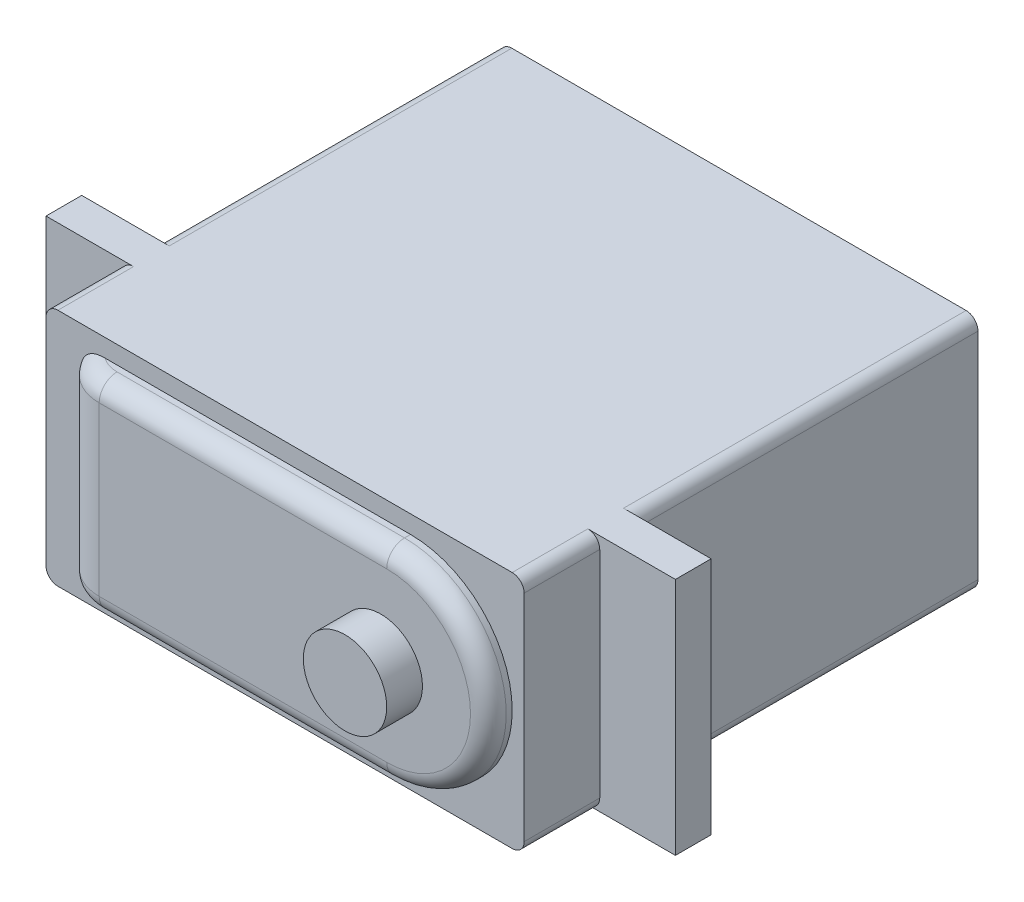
ISO-10303-21;
HEADER;
FILE_DESCRIPTION(('STEP AP214'),'2;1');
FILE_NAME('part.step','',(''),(''),'','','');
FILE_SCHEMA(('AUTOMOTIVE_DESIGN { 1 0 10303 214 1 1 1 1 }'));
ENDSEC;
DATA;
#1=APPLICATION_CONTEXT('core data for automotive mechanical design processes');
#2=APPLICATION_PROTOCOL_DEFINITION('international standard','automotive_design',2000,#1);
#3=PRODUCT_CONTEXT('',#1,'mechanical');
#4=PRODUCT('Part','Part','',(#3));
#5=PRODUCT_RELATED_PRODUCT_CATEGORY('part','',(#4));
#6=PRODUCT_DEFINITION_FORMATION('','',#4);
#7=PRODUCT_DEFINITION_CONTEXT('part definition',#1,'design');
#8=PRODUCT_DEFINITION('design','',#6,#7);
#9=PRODUCT_DEFINITION_SHAPE('','',#8);
#10=(LENGTH_UNIT() NAMED_UNIT(*) SI_UNIT(.MILLI.,.METRE.));
#11=(NAMED_UNIT(*) PLANE_ANGLE_UNIT() SI_UNIT($,.RADIAN.));
#12=(NAMED_UNIT(*) SI_UNIT($,.STERADIAN.) SOLID_ANGLE_UNIT());
#13=UNCERTAINTY_MEASURE_WITH_UNIT(LENGTH_MEASURE(1.E-05),#10,'distance_accuracy_value','');
#14=(GEOMETRIC_REPRESENTATION_CONTEXT(3) GLOBAL_UNCERTAINTY_ASSIGNED_CONTEXT((#13)) GLOBAL_UNIT_ASSIGNED_CONTEXT((#10,
#11,#12)) REPRESENTATION_CONTEXT('',''));
#15=CARTESIAN_POINT('',(0.,0.,0.));
#16=DIRECTION('',(0.,0.,1.));
#17=DIRECTION('',(1.,0.,0.));
#18=AXIS2_PLACEMENT_3D('',#15,#16,#17);
#19=CARTESIAN_POINT('',(0.,0.,38.1));
#20=DIRECTION('',(0.,0.,1.));
#21=DIRECTION('',(1.,0.,0.));
#22=AXIS2_PLACEMENT_3D('',#19,#20,#21);
#23=PLANE('',#22);
#24=DIRECTION('',(0.,1.,0.));
#25=VECTOR('',#24,1.);
#26=CARTESIAN_POINT('',(20.066,10.033,38.1));
#27=LINE('',#26,#25);
#28=CARTESIAN_POINT('',(20.066,-9.03299999999999,38.1));
#29=VERTEX_POINT('',#28);
#30=CARTESIAN_POINT('',(20.066,9.033,38.1));
#31=VERTEX_POINT('',#30);
#32=EDGE_CURVE('E297',#29,#31,#27,.T.);
#33=ORIENTED_EDGE('',*,*,#32,.T.);
#34=CARTESIAN_POINT('',(19.066,9.033,38.1));
#35=DIRECTION('',(0.,0.,1.));
#36=DIRECTION('',(1.,0.,0.));
#37=AXIS2_PLACEMENT_3D('',#34,#35,#36);
#38=CIRCLE('',#37,1.);
#39=CARTESIAN_POINT('',(19.066,10.033,38.1));
#40=VERTEX_POINT('',#39);
#41=EDGE_CURVE('E460',#31,#40,#38,.T.);
#42=ORIENTED_EDGE('',*,*,#41,.T.);
#43=DIRECTION('',(-1.,0.,0.));
#44=VECTOR('',#43,1.);
#45=CARTESIAN_POINT('',(-20.066,10.033,38.1));
#46=LINE('',#45,#44);
#47=CARTESIAN_POINT('',(-19.066,10.033,38.1));
#48=VERTEX_POINT('',#47);
#49=EDGE_CURVE('E300',#40,#48,#46,.T.);
#50=ORIENTED_EDGE('',*,*,#49,.T.);
#51=CARTESIAN_POINT('',(-19.066,9.033,38.1));
#52=DIRECTION('',(0.,0.,1.));
#53=DIRECTION('',(1.,0.,0.));
#54=AXIS2_PLACEMENT_3D('',#51,#52,#53);
#55=CIRCLE('',#54,1.);
#56=CARTESIAN_POINT('',(-20.066,9.033,38.1));
#57=VERTEX_POINT('',#56);
#58=EDGE_CURVE('E458',#48,#57,#55,.T.);
#59=ORIENTED_EDGE('',*,*,#58,.T.);
#60=DIRECTION('',(0.,-1.,0.));
#61=VECTOR('',#60,1.);
#62=CARTESIAN_POINT('',(-20.066,10.033,38.1));
#63=LINE('',#62,#61);
#64=CARTESIAN_POINT('',(-20.066,-9.033,38.1));
#65=VERTEX_POINT('',#64);
#66=EDGE_CURVE('E304',#57,#65,#63,.T.);
#67=ORIENTED_EDGE('',*,*,#66,.T.);
#68=CARTESIAN_POINT('',(-19.066,-9.033,38.1));
#69=DIRECTION('',(0.,0.,1.));
#70=DIRECTION('',(1.,0.,0.));
#71=AXIS2_PLACEMENT_3D('',#68,#69,#70);
#72=CIRCLE('',#71,1.);
#73=CARTESIAN_POINT('',(-19.066,-10.033,38.1));
#74=VERTEX_POINT('',#73);
#75=EDGE_CURVE('E454',#65,#74,#72,.T.);
#76=ORIENTED_EDGE('',*,*,#75,.T.);
#77=DIRECTION('',(1.,0.,0.));
#78=VECTOR('',#77,1.);
#79=CARTESIAN_POINT('',(-20.066,-10.033,38.1));
#80=LINE('',#79,#78);
#81=CARTESIAN_POINT('',(19.066,-10.033,38.1));
#82=VERTEX_POINT('',#81);
#83=EDGE_CURVE('E307',#74,#82,#80,.T.);
#84=ORIENTED_EDGE('',*,*,#83,.T.);
#85=CARTESIAN_POINT('',(19.066,-9.03299999999999,38.1));
#86=DIRECTION('',(0.,0.,1.));
#87=DIRECTION('',(1.,0.,0.));
#88=AXIS2_PLACEMENT_3D('',#85,#86,#87);
#89=CIRCLE('',#88,1.);
#90=EDGE_CURVE('E456',#82,#29,#89,.T.);
#91=ORIENTED_EDGE('',*,*,#90,.T.);
#92=EDGE_LOOP('',(#33,#42,#50,#59,#67,#76,#84,#91));
#93=FACE_BOUND('',#92,.T.);
#94=DIRECTION('',(1.,0.,0.));
#95=VECTOR('',#94,1.);
#96=CARTESIAN_POINT('',(-17.066,-8.533,38.1));
#97=LINE('',#96,#95);
#98=CARTESIAN_POINT('',(-15.1018983848623,-8.533,38.1));
#99=VERTEX_POINT('',#98);
#100=CARTESIAN_POINT('',(10.533,-8.533,38.1));
#101=VERTEX_POINT('',#100);
#102=EDGE_CURVE('E233',#99,#101,#97,.T.);
#103=ORIENTED_EDGE('',*,*,#102,.F.);
#104=CARTESIAN_POINT('',(-15.1018983848623,-8.533,38.1));
#105=CARTESIAN_POINT('',(-15.1861928300058,-8.53303049348242,38.1));
#106=CARTESIAN_POINT('',(-15.2706152750848,-8.53044021391061,38.1));
#107=CARTESIAN_POINT('',(-15.4394485442143,-8.51852978729891,38.1));
#108=CARTESIAN_POINT('',(-15.5238565519978,-8.50917131507559,38.1));
#109=CARTESIAN_POINT('',(-15.6923665934414,-8.48204894050768,38.1));
#110=CARTESIAN_POINT('',(-15.7764542345098,-8.46419067214507,38.1));
#111=CARTESIAN_POINT('',(-15.9418119669954,-8.41885763557327,38.1));
#112=CARTESIAN_POINT('',(-16.0230887290638,-8.39140763843768,38.1));
#113=CARTESIAN_POINT('',(-16.1870195429121,-8.32363201190132,38.1));
#114=CARTESIAN_POINT('',(-16.2693581236052,-8.28252747099281,38.1));
#115=CARTESIAN_POINT('',(-16.4261874404223,-8.18791315868087,38.1));
#116=CARTESIAN_POINT('',(-16.5007099454931,-8.13445667863754,38.1));
#117=CARTESIAN_POINT('',(-16.6399821154947,-8.0148323562304,38.1));
#118=CARTESIAN_POINT('',(-16.7046419811275,-7.94855889258086,38.1));
#119=CARTESIAN_POINT('',(-16.8203441892176,-7.80482583940034,38.1));
#120=CARTESIAN_POINT('',(-16.8713749954642,-7.72735685843943,38.1));
#121=CARTESIAN_POINT('',(-16.9523285101543,-7.57248285425902,38.1));
#122=CARTESIAN_POINT('',(-16.9839184483545,-7.49594652175267,38.1));
#123=CARTESIAN_POINT('',(-17.0322873251939,-7.33842702834449,38.1));
#124=CARTESIAN_POINT('',(-17.0491034277141,-7.25745557293459,38.1));
#125=CARTESIAN_POINT('',(-17.0607576085038,-7.15204282013826,38.1));
#126=CARTESIAN_POINT('',(-17.0627238777869,-7.12825842019382,38.1));
#127=CARTESIAN_POINT('',(-17.0653430653476,-7.08065317082717,38.1));
#128=CARTESIAN_POINT('',(-17.0659979500237,-7.05683242965972,38.1));
#129=CARTESIAN_POINT('',(-17.0660000000003,-7.03300000000003,38.1));
#130=B_SPLINE_CURVE_WITH_KNOTS('',3,(#104,#105,#106,#107,#108,#109,#110,#111,#112,#113,#114,
#115,#116,#117,#118,#119,#120,#121,#122,#123,#124,#125,#126,#127,#128,#129),.UNSPECIFIED.,.F.,
.F.,(4,2,2,2,2,2,2,2,2,2,2,2,4),(0.,0.253036054676526,0.507516269003883,0.764890113214672,
1.02160413132402,1.2966340701809,1.57049886929465,1.84672487994705,2.12318396420879,
2.3702535276615,2.61669978830203,2.68827214822505,2.75973710602753),.UNSPECIFIED.);
#131=CARTESIAN_POINT('',(-17.066,-7.033,38.1));
#132=VERTEX_POINT('',#131);
#133=EDGE_CURVE('E341',#99,#132,#130,.T.);
#134=ORIENTED_EDGE('',*,*,#133,.T.);
#135=DIRECTION('',(0.,-1.,0.));
#136=VECTOR('',#135,1.);
#137=CARTESIAN_POINT('',(-17.066,8.533,38.1));
#138=LINE('',#137,#136);
#139=CARTESIAN_POINT('',(-17.066,7.033,38.1));
#140=VERTEX_POINT('',#139);
#141=EDGE_CURVE('E238',#140,#132,#138,.T.);
#142=ORIENTED_EDGE('',*,*,#141,.F.);
#143=CARTESIAN_POINT('',(-17.066,7.033,38.1));
#144=CARTESIAN_POINT('',(-17.0660014445438,7.0706495800666,38.1));
#145=CARTESIAN_POINT('',(-17.0643620310347,7.10828005562255,38.1));
#146=CARTESIAN_POINT('',(-17.0578336457456,7.18324969632347,38.1));
#147=CARTESIAN_POINT('',(-17.0529454036838,7.22058892498031,38.1));
#148=CARTESIAN_POINT('',(-17.0335104923335,7.33149635839915,38.1));
#149=CARTESIAN_POINT('',(-17.0141929836905,7.40428269909116,38.1));
#150=CARTESIAN_POINT('',(-16.9636434249292,7.54549755422297,38.1));
#151=CARTESIAN_POINT('',(-16.9324157942848,7.61392767414244,38.1));
#152=CARTESIAN_POINT('',(-16.8592733327388,7.74485268845999,38.1));
#153=CARTESIAN_POINT('',(-16.8173513439853,7.80734356905857,38.1));
#154=CARTESIAN_POINT('',(-16.7227321031506,7.9271286851815,38.1));
#155=CARTESIAN_POINT('',(-16.6697088420691,7.98416420689811,38.1));
#156=CARTESIAN_POINT('',(-16.5557516091646,8.08955704274093,38.1));
#157=CARTESIAN_POINT('',(-16.4948213695385,8.13791842567985,38.1));
#158=CARTESIAN_POINT('',(-16.3596628079616,8.23057676986853,38.1));
#159=CARTESIAN_POINT('',(-16.2847094274884,8.27381112131396,38.1));
#160=CARTESIAN_POINT('',(-16.1292771830575,8.34945231749907,38.1));
#161=CARTESIAN_POINT('',(-16.0487802004377,8.38182140851163,38.1));
#162=CARTESIAN_POINT('',(-15.8969033296351,8.43214203163526,38.1));
#163=CARTESIAN_POINT('',(-15.8259889891192,8.45153463902824,38.1));
#164=CARTESIAN_POINT('',(-15.6825672853381,8.48362733934653,38.1));
#165=CARTESIAN_POINT('',(-15.6100576479851,8.49631713375276,38.1));
#166=CARTESIAN_POINT('',(-15.4649450694109,8.51570495314429,38.1));
#167=CARTESIAN_POINT('',(-15.3923488701463,8.52245599531901,38.1));
#168=CARTESIAN_POINT('',(-15.2471110421393,8.53110315213153,38.1));
#169=CARTESIAN_POINT('',(-15.1744704529082,8.53301609977285,38.1));
#170=CARTESIAN_POINT('',(-15.1018983848623,8.533,38.1));
#171=B_SPLINE_CURVE_WITH_KNOTS('',3,(#143,#144,#145,#146,#147,#148,#149,#150,#151,#152,#153,
#154,#155,#156,#157,#158,#159,#160,#161,#162,#163,#164,#165,#166,#167,#168,#169,#170),
.UNSPECIFIED.,.F.,.F.,(4,2,2,2,2,2,2,2,2,2,2,2,2,4),(0.,0.112875600805839,0.225725857223585,
0.450454411501872,0.675099657041678,0.89989565643018,1.13256608863829,1.36512709413667,
1.6237466289368,1.88325571000123,2.10346275141178,2.32400715235833,2.54256209447353,
2.76035557381231),.UNSPECIFIED.);
#172=CARTESIAN_POINT('',(-15.1018983848623,8.533,38.1));
#173=VERTEX_POINT('',#172);
#174=EDGE_CURVE('E348',#140,#173,#171,.T.);
#175=ORIENTED_EDGE('',*,*,#174,.T.);
#176=DIRECTION('',(-1.,0.,0.));
#177=VECTOR('',#176,1.);
#178=CARTESIAN_POINT('',(-17.066,8.533,38.1));
#179=LINE('',#178,#177);
#180=CARTESIAN_POINT('',(10.533,8.533,38.1));
#181=VERTEX_POINT('',#180);
#182=EDGE_CURVE('E241',#181,#173,#179,.T.);
#183=ORIENTED_EDGE('',*,*,#182,.F.);
#184=CARTESIAN_POINT('',(10.533,0.,38.1));
#185=DIRECTION('',(0.,0.,1.));
#186=DIRECTION('',(1.,0.,0.));
#187=AXIS2_PLACEMENT_3D('',#184,#185,#186);
#188=CIRCLE('',#187,8.533);
#189=EDGE_CURVE('E222',#101,#181,#188,.T.);
#190=ORIENTED_EDGE('',*,*,#189,.F.);
#191=EDGE_LOOP('',(#103,#134,#142,#175,#183,#190));
#192=FACE_BOUND('',#191,.T.);
#193=ADVANCED_FACE('F38',(#93,#192),#23,.T.);
#194=CARTESIAN_POINT('',(20.066,10.033,38.1));
#195=DIRECTION('',(-1.,0.,0.));
#196=DIRECTION('',(0.,-1.,0.));
#197=AXIS2_PLACEMENT_3D('',#194,#195,#196);
#198=PLANE('',#197);
#199=DIRECTION('',(0.,-1.,0.));
#200=VECTOR('',#199,1.);
#201=CARTESIAN_POINT('',(20.066,0.,31.75));
#202=LINE('',#201,#200);
#203=CARTESIAN_POINT('',(20.066,9.033,31.75));
#204=VERTEX_POINT('',#203);
#205=CARTESIAN_POINT('',(20.066,-9.03299999999999,31.75));
#206=VERTEX_POINT('',#205);
#207=EDGE_CURVE('E228',#204,#206,#202,.T.);
#208=ORIENTED_EDGE('',*,*,#207,.F.);
#209=DIRECTION('',(0.,0.,-1.));
#210=VECTOR('',#209,1.);
#211=CARTESIAN_POINT('',(20.066,9.033,38.1));
#212=LINE('',#211,#210);
#213=EDGE_CURVE('E452',#204,#31,#212,.F.);
#214=ORIENTED_EDGE('',*,*,#213,.T.);
#215=ORIENTED_EDGE('',*,*,#32,.F.);
#216=DIRECTION('',(0.,0.,-1.));
#217=VECTOR('',#216,1.);
#218=CARTESIAN_POINT('',(20.066,-9.03299999999999,38.1));
#219=LINE('',#218,#217);
#220=EDGE_CURVE('E449',#29,#206,#219,.T.);
#221=ORIENTED_EDGE('',*,*,#220,.T.);
#222=EDGE_LOOP('',(#208,#214,#215,#221));
#223=FACE_BOUND('',#222,.T.);
#224=ADVANCED_FACE('F362',(#223),#198,.F.);
#225=CARTESIAN_POINT('',(-20.066,10.033,38.1));
#226=DIRECTION('',(1.,0.,0.));
#227=DIRECTION('',(0.,1.,0.));
#228=AXIS2_PLACEMENT_3D('',#225,#226,#227);
#229=PLANE('',#228);
#230=ORIENTED_EDGE('',*,*,#66,.F.);
#231=DIRECTION('',(0.,0.,-1.));
#232=VECTOR('',#231,1.);
#233=CARTESIAN_POINT('',(-20.066,9.033,38.1));
#234=LINE('',#233,#232);
#235=CARTESIAN_POINT('',(-20.066,9.033,31.75));
#236=VERTEX_POINT('',#235);
#237=EDGE_CURVE('E469',#57,#236,#234,.T.);
#238=ORIENTED_EDGE('',*,*,#237,.T.);
#239=DIRECTION('',(0.,1.,0.));
#240=VECTOR('',#239,1.);
#241=CARTESIAN_POINT('',(-20.066,0.,31.75));
#242=LINE('',#241,#240);
#243=CARTESIAN_POINT('',(-20.066,-9.033,31.75));
#244=VERTEX_POINT('',#243);
#245=EDGE_CURVE('E270',#244,#236,#242,.T.);
#246=ORIENTED_EDGE('',*,*,#245,.F.);
#247=DIRECTION('',(0.,0.,-1.));
#248=VECTOR('',#247,1.);
#249=CARTESIAN_POINT('',(-20.066,-9.033,38.1));
#250=LINE('',#249,#248);
#251=EDGE_CURVE('E467',#244,#65,#250,.F.);
#252=ORIENTED_EDGE('',*,*,#251,.T.);
#253=EDGE_LOOP('',(#230,#238,#246,#252));
#254=FACE_BOUND('',#253,.T.);
#255=ADVANCED_FACE('F379',(#254),#229,.F.);
#256=DIRECTION('',(0.,1.,0.));
#257=VECTOR('',#256,1.);
#258=CARTESIAN_POINT('',(20.066,10.033,0.));
#259=LINE('',#258,#257);
#260=CARTESIAN_POINT('',(20.066,-9.03299999999999,0.));
#261=VERTEX_POINT('',#260);
#262=CARTESIAN_POINT('',(20.066,9.033,0.));
#263=VERTEX_POINT('',#262);
#264=EDGE_CURVE('E296',#261,#263,#259,.T.);
#265=ORIENTED_EDGE('',*,*,#264,.T.);
#266=DIRECTION('',(0.,0.,-1.));
#267=VECTOR('',#266,1.);
#268=CARTESIAN_POINT('',(20.066,9.033,38.1));
#269=LINE('',#268,#267);
#270=CARTESIAN_POINT('',(20.066,9.033,28.75));
#271=VERTEX_POINT('',#270);
#272=EDGE_CURVE('E447',#263,#271,#269,.F.);
#273=ORIENTED_EDGE('',*,*,#272,.T.);
#274=DIRECTION('',(0.,-1.,0.));
#275=VECTOR('',#274,1.);
#276=CARTESIAN_POINT('',(20.066,0.,28.75));
#277=LINE('',#276,#275);
#278=CARTESIAN_POINT('',(20.066,-9.03299999999999,28.75));
#279=VERTEX_POINT('',#278);
#280=EDGE_CURVE('E247',#271,#279,#277,.T.);
#281=ORIENTED_EDGE('',*,*,#280,.T.);
#282=DIRECTION('',(0.,0.,-1.));
#283=VECTOR('',#282,1.);
#284=CARTESIAN_POINT('',(20.066,-9.03299999999999,38.1));
#285=LINE('',#284,#283);
#286=EDGE_CURVE('E444',#279,#261,#285,.T.);
#287=ORIENTED_EDGE('',*,*,#286,.T.);
#288=EDGE_LOOP('',(#265,#273,#281,#287));
#289=FACE_BOUND('',#288,.T.);
#290=ADVANCED_FACE('F382',(#289),#198,.F.);
#291=CARTESIAN_POINT('',(-20.066,10.033,38.1));
#292=DIRECTION('',(0.,-1.,0.));
#293=DIRECTION('',(0.,0.,-1.));
#294=AXIS2_PLACEMENT_3D('',#291,#292,#293);
#295=PLANE('',#294);
#296=DIRECTION('',(1.,0.,0.));
#297=VECTOR('',#296,1.);
#298=CARTESIAN_POINT('',(0.,10.033,28.75));
#299=LINE('',#298,#297);
#300=CARTESIAN_POINT('',(19.066,10.033,28.75));
#301=VERTEX_POINT('',#300);
#302=CARTESIAN_POINT('',(26.416,10.033,28.75));
#303=VERTEX_POINT('',#302);
#304=EDGE_CURVE('E250',#301,#303,#299,.T.);
#305=ORIENTED_EDGE('',*,*,#304,.F.);
#306=DIRECTION('',(0.,0.,-1.));
#307=VECTOR('',#306,1.);
#308=CARTESIAN_POINT('',(19.066,10.033,38.1));
#309=LINE('',#308,#307);
#310=CARTESIAN_POINT('',(19.066,10.033,0.));
#311=VERTEX_POINT('',#310);
#312=EDGE_CURVE('E433',#301,#311,#309,.T.);
#313=ORIENTED_EDGE('',*,*,#312,.T.);
#314=DIRECTION('',(-1.,0.,0.));
#315=VECTOR('',#314,1.);
#316=CARTESIAN_POINT('',(-20.066,10.033,0.));
#317=LINE('',#316,#315);
#318=CARTESIAN_POINT('',(-19.066,10.033,0.));
#319=VERTEX_POINT('',#318);
#320=EDGE_CURVE('E313',#311,#319,#317,.T.);
#321=ORIENTED_EDGE('',*,*,#320,.T.);
#322=DIRECTION('',(0.,0.,-1.));
#323=VECTOR('',#322,1.);
#324=CARTESIAN_POINT('',(-19.066,10.033,38.1));
#325=LINE('',#324,#323);
#326=CARTESIAN_POINT('',(-19.066,10.033,28.75));
#327=VERTEX_POINT('',#326);
#328=EDGE_CURVE('E427',#319,#327,#325,.F.);
#329=ORIENTED_EDGE('',*,*,#328,.T.);
#330=DIRECTION('',(-1.,0.,0.));
#331=VECTOR('',#330,1.);
#332=CARTESIAN_POINT('',(0.,10.033,28.75));
#333=LINE('',#332,#331);
#334=CARTESIAN_POINT('',(-26.416,10.033,28.75));
#335=VERTEX_POINT('',#334);
#336=EDGE_CURVE('E279',#327,#335,#333,.T.);
#337=ORIENTED_EDGE('',*,*,#336,.T.);
#338=DIRECTION('',(0.,0.,1.));
#339=VECTOR('',#338,1.);
#340=CARTESIAN_POINT('',(-26.416,10.033,28.75));
#341=LINE('',#340,#339);
#342=CARTESIAN_POINT('',(-26.416,10.033,31.75));
#343=VERTEX_POINT('',#342);
#344=EDGE_CURVE('E282',#335,#343,#341,.T.);
#345=ORIENTED_EDGE('',*,*,#344,.T.);
#346=DIRECTION('',(-1.,0.,0.));
#347=VECTOR('',#346,1.);
#348=CARTESIAN_POINT('',(0.,10.033,31.75));
#349=LINE('',#348,#347);
#350=CARTESIAN_POINT('',(-19.066,10.033,31.75));
#351=VERTEX_POINT('',#350);
#352=EDGE_CURVE('E274',#351,#343,#349,.T.);
#353=ORIENTED_EDGE('',*,*,#352,.F.);
#354=DIRECTION('',(0.,0.,-1.));
#355=VECTOR('',#354,1.);
#356=CARTESIAN_POINT('',(-19.066,10.033,38.1));
#357=LINE('',#356,#355);
#358=EDGE_CURVE('E425',#351,#48,#357,.F.);
#359=ORIENTED_EDGE('',*,*,#358,.T.);
#360=ORIENTED_EDGE('',*,*,#49,.F.);
#361=DIRECTION('',(0.,0.,-1.));
#362=VECTOR('',#361,1.);
#363=CARTESIAN_POINT('',(19.066,10.033,38.1));
#364=LINE('',#363,#362);
#365=CARTESIAN_POINT('',(19.066,10.033,31.75));
#366=VERTEX_POINT('',#365);
#367=EDGE_CURVE('E430',#40,#366,#364,.T.);
#368=ORIENTED_EDGE('',*,*,#367,.T.);
#369=DIRECTION('',(1.,0.,0.));
#370=VECTOR('',#369,1.);
#371=CARTESIAN_POINT('',(0.,10.033,31.75));
#372=LINE('',#371,#370);
#373=CARTESIAN_POINT('',(26.416,10.033,31.75));
#374=VERTEX_POINT('',#373);
#375=EDGE_CURVE('E259',#366,#374,#372,.T.);
#376=ORIENTED_EDGE('',*,*,#375,.T.);
#377=DIRECTION('',(0.,0.,1.));
#378=VECTOR('',#377,1.);
#379=CARTESIAN_POINT('',(26.416,10.033,28.75));
#380=LINE('',#379,#378);
#381=EDGE_CURVE('E267',#303,#374,#380,.T.);
#382=ORIENTED_EDGE('',*,*,#381,.F.);
#383=EDGE_LOOP('',(#305,#313,#321,#329,#337,#345,#353,#359,#360,#368,#376,#382));
#384=FACE_BOUND('',#383,.T.);
#385=ADVANCED_FACE('F377',(#384),#295,.F.);
#386=DIRECTION('',(0.,1.,0.));
#387=VECTOR('',#386,1.);
#388=CARTESIAN_POINT('',(-20.066,0.,28.75));
#389=LINE('',#388,#387);
#390=CARTESIAN_POINT('',(-20.066,-9.033,28.75));
#391=VERTEX_POINT('',#390);
#392=CARTESIAN_POINT('',(-20.066,9.033,28.75));
#393=VERTEX_POINT('',#392);
#394=EDGE_CURVE('E271',#391,#393,#389,.T.);
#395=ORIENTED_EDGE('',*,*,#394,.T.);
#396=DIRECTION('',(0.,0.,-1.));
#397=VECTOR('',#396,1.);
#398=CARTESIAN_POINT('',(-20.066,9.033,38.1));
#399=LINE('',#398,#397);
#400=CARTESIAN_POINT('',(-20.066,9.033,0.));
#401=VERTEX_POINT('',#400);
#402=EDGE_CURVE('E464',#393,#401,#399,.T.);
#403=ORIENTED_EDGE('',*,*,#402,.T.);
#404=DIRECTION('',(0.,-1.,0.));
#405=VECTOR('',#404,1.);
#406=CARTESIAN_POINT('',(-20.066,10.033,0.));
#407=LINE('',#406,#405);
#408=CARTESIAN_POINT('',(-20.066,-9.033,0.));
#409=VERTEX_POINT('',#408);
#410=EDGE_CURVE('E316',#401,#409,#407,.T.);
#411=ORIENTED_EDGE('',*,*,#410,.T.);
#412=DIRECTION('',(0.,0.,-1.));
#413=VECTOR('',#412,1.);
#414=CARTESIAN_POINT('',(-20.066,-9.033,38.1));
#415=LINE('',#414,#413);
#416=EDGE_CURVE('E462',#409,#391,#415,.F.);
#417=ORIENTED_EDGE('',*,*,#416,.T.);
#418=EDGE_LOOP('',(#395,#403,#411,#417));
#419=FACE_BOUND('',#418,.T.);
#420=ADVANCED_FACE('F374',(#419),#229,.F.);
#421=CARTESIAN_POINT('',(-20.066,-10.033,38.1));
#422=DIRECTION('',(0.,1.,0.));
#423=DIRECTION('',(0.,0.,1.));
#424=AXIS2_PLACEMENT_3D('',#421,#422,#423);
#425=PLANE('',#424);
#426=DIRECTION('',(-1.,0.,0.));
#427=VECTOR('',#426,1.);
#428=CARTESIAN_POINT('',(0.,-10.033,28.75));
#429=LINE('',#428,#427);
#430=CARTESIAN_POINT('',(-19.066,-10.033,28.75));
#431=VERTEX_POINT('',#430);
#432=CARTESIAN_POINT('',(-26.416,-10.033,28.75));
#433=VERTEX_POINT('',#432);
#434=EDGE_CURVE('E53',#431,#433,#429,.T.);
#435=ORIENTED_EDGE('',*,*,#434,.F.);
#436=DIRECTION('',(0.,0.,-1.));
#437=VECTOR('',#436,1.);
#438=CARTESIAN_POINT('',(-19.066,-10.033,38.1));
#439=LINE('',#438,#437);
#440=CARTESIAN_POINT('',(-19.066,-10.033,0.));
#441=VERTEX_POINT('',#440);
#442=EDGE_CURVE('E479',#431,#441,#439,.T.);
#443=ORIENTED_EDGE('',*,*,#442,.T.);
#444=DIRECTION('',(1.,0.,0.));
#445=VECTOR('',#444,1.);
#446=CARTESIAN_POINT('',(-20.066,-10.033,0.));
#447=LINE('',#446,#445);
#448=CARTESIAN_POINT('',(19.066,-10.033,0.));
#449=VERTEX_POINT('',#448);
#450=EDGE_CURVE('E301',#441,#449,#447,.T.);
#451=ORIENTED_EDGE('',*,*,#450,.T.);
#452=DIRECTION('',(0.,0.,-1.));
#453=VECTOR('',#452,1.);
#454=CARTESIAN_POINT('',(19.066,-10.033,38.1));
#455=LINE('',#454,#453);
#456=CARTESIAN_POINT('',(19.066,-10.033,28.75));
#457=VERTEX_POINT('',#456);
#458=EDGE_CURVE('E477',#449,#457,#455,.F.);
#459=ORIENTED_EDGE('',*,*,#458,.T.);
#460=DIRECTION('',(1.,0.,0.));
#461=VECTOR('',#460,1.);
#462=CARTESIAN_POINT('',(0.,-10.033,28.75));
#463=LINE('',#462,#461);
#464=CARTESIAN_POINT('',(26.416,-10.033,28.75));
#465=VERTEX_POINT('',#464);
#466=EDGE_CURVE('E61',#457,#465,#463,.T.);
#467=ORIENTED_EDGE('',*,*,#466,.T.);
#468=DIRECTION('',(0.,0.,1.));
#469=VECTOR('',#468,1.);
#470=CARTESIAN_POINT('',(26.416,-10.033,28.75));
#471=LINE('',#470,#469);
#472=CARTESIAN_POINT('',(26.416,-10.033,31.75));
#473=VERTEX_POINT('',#472);
#474=EDGE_CURVE('E256',#465,#473,#471,.T.);
#475=ORIENTED_EDGE('',*,*,#474,.T.);
#476=DIRECTION('',(1.,0.,0.));
#477=VECTOR('',#476,1.);
#478=CARTESIAN_POINT('',(0.,-10.033,31.75));
#479=LINE('',#478,#477);
#480=CARTESIAN_POINT('',(19.066,-10.033,31.75));
#481=VERTEX_POINT('',#480);
#482=EDGE_CURVE('E251',#481,#473,#479,.T.);
#483=ORIENTED_EDGE('',*,*,#482,.F.);
#484=DIRECTION('',(0.,0.,-1.));
#485=VECTOR('',#484,1.);
#486=CARTESIAN_POINT('',(19.066,-10.033,38.1));
#487=LINE('',#486,#485);
#488=EDGE_CURVE('E475',#481,#82,#487,.F.);
#489=ORIENTED_EDGE('',*,*,#488,.T.);
#490=ORIENTED_EDGE('',*,*,#83,.F.);
#491=DIRECTION('',(0.,0.,-1.));
#492=VECTOR('',#491,1.);
#493=CARTESIAN_POINT('',(-19.066,-10.033,38.1));
#494=LINE('',#493,#492);
#495=CARTESIAN_POINT('',(-19.066,-10.033,31.75));
#496=VERTEX_POINT('',#495);
#497=EDGE_CURVE('E472',#74,#496,#494,.T.);
#498=ORIENTED_EDGE('',*,*,#497,.T.);
#499=DIRECTION('',(-1.,0.,0.));
#500=VECTOR('',#499,1.);
#501=CARTESIAN_POINT('',(0.,-10.033,31.75));
#502=LINE('',#501,#500);
#503=CARTESIAN_POINT('',(-26.416,-10.033,31.75));
#504=VERTEX_POINT('',#503);
#505=EDGE_CURVE('E285',#496,#504,#502,.T.);
#506=ORIENTED_EDGE('',*,*,#505,.T.);
#507=DIRECTION('',(0.,0.,1.));
#508=VECTOR('',#507,1.);
#509=CARTESIAN_POINT('',(-26.416,-10.033,28.75));
#510=LINE('',#509,#508);
#511=EDGE_CURVE('E294',#433,#504,#510,.T.);
#512=ORIENTED_EDGE('',*,*,#511,.F.);
#513=EDGE_LOOP('',(#435,#443,#451,#459,#467,#475,#483,#489,#490,#498,#506,#512));
#514=FACE_BOUND('',#513,.T.);
#515=ADVANCED_FACE('F370',(#514),#425,.F.);
#516=CARTESIAN_POINT('',(0.,0.,0.));
#517=DIRECTION('',(0.,0.,1.));
#518=DIRECTION('',(1.,0.,0.));
#519=AXIS2_PLACEMENT_3D('',#516,#517,#518);
#520=PLANE('',#519);
#521=ORIENTED_EDGE('',*,*,#320,.F.);
#522=CARTESIAN_POINT('',(19.066,9.033,0.));
#523=DIRECTION('',(0.,0.,1.));
#524=DIRECTION('',(1.,0.,0.));
#525=AXIS2_PLACEMENT_3D('',#522,#523,#524);
#526=CIRCLE('',#525,1.);
#527=EDGE_CURVE('E442',#311,#263,#526,.F.);
#528=ORIENTED_EDGE('',*,*,#527,.T.);
#529=ORIENTED_EDGE('',*,*,#264,.F.);
#530=CARTESIAN_POINT('',(19.066,-9.03299999999999,0.));
#531=DIRECTION('',(0.,0.,1.));
#532=DIRECTION('',(1.,0.,0.));
#533=AXIS2_PLACEMENT_3D('',#530,#531,#532);
#534=CIRCLE('',#533,1.);
#535=EDGE_CURVE('E436',#261,#449,#534,.F.);
#536=ORIENTED_EDGE('',*,*,#535,.T.);
#537=ORIENTED_EDGE('',*,*,#450,.F.);
#538=CARTESIAN_POINT('',(-19.066,-9.033,0.));
#539=DIRECTION('',(0.,0.,1.));
#540=DIRECTION('',(1.,0.,0.));
#541=AXIS2_PLACEMENT_3D('',#538,#539,#540);
#542=CIRCLE('',#541,1.);
#543=EDGE_CURVE('E438',#441,#409,#542,.F.);
#544=ORIENTED_EDGE('',*,*,#543,.T.);
#545=ORIENTED_EDGE('',*,*,#410,.F.);
#546=CARTESIAN_POINT('',(-19.066,9.033,0.));
#547=DIRECTION('',(0.,0.,1.));
#548=DIRECTION('',(1.,0.,0.));
#549=AXIS2_PLACEMENT_3D('',#546,#547,#548);
#550=CIRCLE('',#549,1.);
#551=EDGE_CURVE('E440',#401,#319,#550,.F.);
#552=ORIENTED_EDGE('',*,*,#551,.T.);
#553=EDGE_LOOP('',(#521,#528,#529,#536,#537,#544,#545,#552));
#554=FACE_BOUND('',#553,.T.);
#555=ADVANCED_FACE('F366',(#554),#520,.F.);
#556=CARTESIAN_POINT('',(-26.416,0.,28.75));
#557=DIRECTION('',(-1.,0.,0.));
#558=DIRECTION('',(0.,-1.,0.));
#559=AXIS2_PLACEMENT_3D('',#556,#557,#558);
#560=PLANE('',#559);
#561=DIRECTION('',(0.,-1.,0.));
#562=VECTOR('',#561,1.);
#563=CARTESIAN_POINT('',(-26.416,0.,31.75));
#564=LINE('',#563,#562);
#565=EDGE_CURVE('E288',#343,#504,#564,.T.);
#566=ORIENTED_EDGE('',*,*,#565,.F.);
#567=ORIENTED_EDGE('',*,*,#344,.F.);
#568=DIRECTION('',(0.,-1.,0.));
#569=VECTOR('',#568,1.);
#570=CARTESIAN_POINT('',(-26.416,0.,28.75));
#571=LINE('',#570,#569);
#572=EDGE_CURVE('E276',#335,#433,#571,.T.);
#573=ORIENTED_EDGE('',*,*,#572,.T.);
#574=ORIENTED_EDGE('',*,*,#511,.T.);
#575=EDGE_LOOP('',(#566,#567,#573,#574));
#576=FACE_BOUND('',#575,.T.);
#577=ADVANCED_FACE('F364',(#576),#560,.T.);
#578=CARTESIAN_POINT('',(0.,0.,28.75));
#579=DIRECTION('',(0.,0.,-1.));
#580=DIRECTION('',(-1.,0.,0.));
#581=AXIS2_PLACEMENT_3D('',#578,#579,#580);
#582=PLANE('',#581);
#583=ORIENTED_EDGE('',*,*,#394,.F.);
#584=CARTESIAN_POINT('',(-19.066,-9.033,28.75));
#585=DIRECTION('',(0.,0.,-1.));
#586=DIRECTION('',(-1.,0.,0.));
#587=AXIS2_PLACEMENT_3D('',#584,#585,#586);
#588=CIRCLE('',#587,1.);
#589=EDGE_CURVE('E491',#391,#431,#588,.F.);
#590=ORIENTED_EDGE('',*,*,#589,.T.);
#591=ORIENTED_EDGE('',*,*,#434,.T.);
#592=ORIENTED_EDGE('',*,*,#572,.F.);
#593=ORIENTED_EDGE('',*,*,#336,.F.);
#594=CARTESIAN_POINT('',(-19.066,9.033,28.75));
#595=DIRECTION('',(0.,0.,-1.));
#596=DIRECTION('',(-1.,0.,0.));
#597=AXIS2_PLACEMENT_3D('',#594,#595,#596);
#598=CIRCLE('',#597,1.);
#599=EDGE_CURVE('E486',#327,#393,#598,.F.);
#600=ORIENTED_EDGE('',*,*,#599,.T.);
#601=EDGE_LOOP('',(#583,#590,#591,#592,#593,#600));
#602=FACE_BOUND('',#601,.T.);
#603=ADVANCED_FACE('F519',(#602),#582,.T.);
#604=CARTESIAN_POINT('',(0.,0.,31.75));
#605=DIRECTION('',(0.,0.,-1.));
#606=DIRECTION('',(-1.,0.,0.));
#607=AXIS2_PLACEMENT_3D('',#604,#605,#606);
#608=PLANE('',#607);
#609=ORIENTED_EDGE('',*,*,#505,.F.);
#610=CARTESIAN_POINT('',(-19.066,-9.033,31.75));
#611=DIRECTION('',(0.,0.,-1.));
#612=DIRECTION('',(-1.,0.,0.));
#613=AXIS2_PLACEMENT_3D('',#610,#611,#612);
#614=CIRCLE('',#613,1.);
#615=EDGE_CURVE('E11',#496,#244,#614,.T.);
#616=ORIENTED_EDGE('',*,*,#615,.T.);
#617=ORIENTED_EDGE('',*,*,#245,.T.);
#618=CARTESIAN_POINT('',(-19.066,9.033,31.75));
#619=DIRECTION('',(0.,0.,-1.));
#620=DIRECTION('',(-1.,0.,0.));
#621=AXIS2_PLACEMENT_3D('',#618,#619,#620);
#622=CIRCLE('',#621,1.);
#623=EDGE_CURVE('E488',#236,#351,#622,.T.);
#624=ORIENTED_EDGE('',*,*,#623,.T.);
#625=ORIENTED_EDGE('',*,*,#352,.T.);
#626=ORIENTED_EDGE('',*,*,#565,.T.);
#627=EDGE_LOOP('',(#609,#616,#617,#624,#625,#626));
#628=FACE_BOUND('',#627,.T.);
#629=ADVANCED_FACE('F514',(#628),#608,.F.);
#630=CARTESIAN_POINT('',(26.416,0.,28.75));
#631=DIRECTION('',(-1.,0.,0.));
#632=DIRECTION('',(0.,-1.,0.));
#633=AXIS2_PLACEMENT_3D('',#630,#631,#632);
#634=PLANE('',#633);
#635=DIRECTION('',(0.,-1.,0.));
#636=VECTOR('',#635,1.);
#637=CARTESIAN_POINT('',(26.416,0.,31.75));
#638=LINE('',#637,#636);
#639=EDGE_CURVE('E261',#374,#473,#638,.T.);
#640=ORIENTED_EDGE('',*,*,#639,.T.);
#641=ORIENTED_EDGE('',*,*,#474,.F.);
#642=DIRECTION('',(0.,-1.,0.));
#643=VECTOR('',#642,1.);
#644=CARTESIAN_POINT('',(26.416,0.,28.75));
#645=LINE('',#644,#643);
#646=EDGE_CURVE('E253',#303,#465,#645,.T.);
#647=ORIENTED_EDGE('',*,*,#646,.F.);
#648=ORIENTED_EDGE('',*,*,#381,.T.);
#649=EDGE_LOOP('',(#640,#641,#647,#648));
#650=FACE_BOUND('',#649,.T.);
#651=ADVANCED_FACE('F550',(#650),#634,.F.);
#652=CARTESIAN_POINT('',(0.,0.,28.75));
#653=DIRECTION('',(0.,0.,-1.));
#654=DIRECTION('',(-1.,0.,0.));
#655=AXIS2_PLACEMENT_3D('',#652,#653,#654);
#656=PLANE('',#655);
#657=ORIENTED_EDGE('',*,*,#280,.F.);
#658=CARTESIAN_POINT('',(19.066,9.033,28.75));
#659=DIRECTION('',(0.,0.,-1.));
#660=DIRECTION('',(-1.,0.,0.));
#661=AXIS2_PLACEMENT_3D('',#658,#659,#660);
#662=CIRCLE('',#661,1.);
#663=EDGE_CURVE('E481',#271,#301,#662,.F.);
#664=ORIENTED_EDGE('',*,*,#663,.T.);
#665=ORIENTED_EDGE('',*,*,#304,.T.);
#666=ORIENTED_EDGE('',*,*,#646,.T.);
#667=ORIENTED_EDGE('',*,*,#466,.F.);
#668=CARTESIAN_POINT('',(19.066,-9.03299999999999,28.75));
#669=DIRECTION('',(0.,0.,-1.));
#670=DIRECTION('',(-1.,0.,0.));
#671=AXIS2_PLACEMENT_3D('',#668,#669,#670);
#672=CIRCLE('',#671,1.);
#673=EDGE_CURVE('E493',#457,#279,#672,.F.);
#674=ORIENTED_EDGE('',*,*,#673,.T.);
#675=EDGE_LOOP('',(#657,#664,#665,#666,#667,#674));
#676=FACE_BOUND('',#675,.T.);
#677=ADVANCED_FACE('F542',(#676),#656,.T.);
#678=CARTESIAN_POINT('',(0.,0.,31.75));
#679=DIRECTION('',(0.,0.,-1.));
#680=DIRECTION('',(-1.,0.,0.));
#681=AXIS2_PLACEMENT_3D('',#678,#679,#680);
#682=PLANE('',#681);
#683=ORIENTED_EDGE('',*,*,#375,.F.);
#684=CARTESIAN_POINT('',(19.066,9.033,31.75));
#685=DIRECTION('',(0.,0.,-1.));
#686=DIRECTION('',(-1.,0.,0.));
#687=AXIS2_PLACEMENT_3D('',#684,#685,#686);
#688=CIRCLE('',#687,1.);
#689=EDGE_CURVE('E484',#366,#204,#688,.T.);
#690=ORIENTED_EDGE('',*,*,#689,.T.);
#691=ORIENTED_EDGE('',*,*,#207,.T.);
#692=CARTESIAN_POINT('',(19.066,-9.03299999999999,31.75));
#693=DIRECTION('',(0.,0.,-1.));
#694=DIRECTION('',(-1.,0.,0.));
#695=AXIS2_PLACEMENT_3D('',#692,#693,#694);
#696=CIRCLE('',#695,1.);
#697=EDGE_CURVE('E46',#206,#481,#696,.T.);
#698=ORIENTED_EDGE('',*,*,#697,.T.);
#699=ORIENTED_EDGE('',*,*,#482,.T.);
#700=ORIENTED_EDGE('',*,*,#639,.F.);
#701=EDGE_LOOP('',(#683,#690,#691,#698,#699,#700));
#702=FACE_BOUND('',#701,.T.);
#703=ADVANCED_FACE('F497',(#702),#682,.F.);
#704=CARTESIAN_POINT('',(-17.066,-8.533,40.1));
#705=DIRECTION('',(0.,1.,0.));
#706=DIRECTION('',(0.,0.,1.));
#707=AXIS2_PLACEMENT_3D('',#704,#705,#706);
#708=PLANE('',#707);
#709=DIRECTION('',(1.,0.,0.));
#710=VECTOR('',#709,1.);
#711=CARTESIAN_POINT('',(-13.6018983848623,-8.533,38.6));
#712=LINE('',#711,#710);
#713=CARTESIAN_POINT('',(10.533,-8.533,38.6));
#714=VERTEX_POINT('',#713);
#715=CARTESIAN_POINT('',(-13.6018983848623,-8.533,38.6));
#716=VERTEX_POINT('',#715);
#717=EDGE_CURVE('E323',#714,#716,#712,.F.);
#718=ORIENTED_EDGE('',*,*,#717,.T.);
#719=CARTESIAN_POINT('',(-13.6018983848623,-8.533,36.1));
#720=DIRECTION('',(0.,1.,0.));
#721=DIRECTION('',(0.,0.,1.));
#722=AXIS2_PLACEMENT_3D('',#719,#720,#721);
#723=CIRCLE('',#722,2.5);
#724=EDGE_CURVE('E236',#716,#99,#723,.F.);
#725=ORIENTED_EDGE('',*,*,#724,.T.);
#726=ORIENTED_EDGE('',*,*,#102,.T.);
#727=DIRECTION('',(0.,0.,-1.));
#728=VECTOR('',#727,1.);
#729=CARTESIAN_POINT('',(10.533,-8.533,40.1));
#730=LINE('',#729,#728);
#731=EDGE_CURVE('E217',#714,#101,#730,.T.);
#732=ORIENTED_EDGE('',*,*,#731,.F.);
#733=EDGE_LOOP('',(#718,#725,#726,#732));
#734=FACE_BOUND('',#733,.T.);
#735=ADVANCED_FACE('F234',(#734),#708,.F.);
#736=CARTESIAN_POINT('',(10.533,0.,40.1));
#737=DIRECTION('',(0.,0.,-1.));
#738=DIRECTION('',(-1.,0.,0.));
#739=AXIS2_PLACEMENT_3D('',#736,#737,#738);
#740=CYLINDRICAL_SURFACE('',#739,8.533);
#741=DIRECTION('',(0.,0.,-1.));
#742=VECTOR('',#741,1.);
#743=CARTESIAN_POINT('',(10.533,8.533,40.1));
#744=LINE('',#743,#742);
#745=CARTESIAN_POINT('',(10.533,8.533,38.6));
#746=VERTEX_POINT('',#745);
#747=EDGE_CURVE('E229',#746,#181,#744,.T.);
#748=ORIENTED_EDGE('',*,*,#747,.F.);
#749=CARTESIAN_POINT('',(10.533,0.,38.6));
#750=DIRECTION('',(0.,0.,1.));
#751=DIRECTION('',(1.,0.,0.));
#752=AXIS2_PLACEMENT_3D('',#749,#750,#751);
#753=CIRCLE('',#752,8.533);
#754=EDGE_CURVE('E225',#746,#714,#753,.F.);
#755=ORIENTED_EDGE('',*,*,#754,.T.);
#756=ORIENTED_EDGE('',*,*,#731,.T.);
#757=ORIENTED_EDGE('',*,*,#189,.T.);
#758=EDGE_LOOP('',(#748,#755,#756,#757));
#759=FACE_BOUND('',#758,.T.);
#760=ADVANCED_FACE('F220',(#759),#740,.T.);
#761=CARTESIAN_POINT('',(-17.066,8.533,40.1));
#762=DIRECTION('',(0.,-1.,0.));
#763=DIRECTION('',(0.,0.,-1.));
#764=AXIS2_PLACEMENT_3D('',#761,#762,#763);
#765=PLANE('',#764);
#766=ORIENTED_EDGE('',*,*,#182,.T.);
#767=CARTESIAN_POINT('',(-13.6018983848623,8.533,36.1));
#768=DIRECTION('',(0.,-1.,0.));
#769=DIRECTION('',(0.,0.,-1.));
#770=AXIS2_PLACEMENT_3D('',#767,#768,#769);
#771=CIRCLE('',#770,2.5);
#772=CARTESIAN_POINT('',(-13.6018983848623,8.533,38.6));
#773=VERTEX_POINT('',#772);
#774=EDGE_CURVE('E332',#173,#773,#771,.F.);
#775=ORIENTED_EDGE('',*,*,#774,.T.);
#776=DIRECTION('',(-1.,0.,0.));
#777=VECTOR('',#776,1.);
#778=CARTESIAN_POINT('',(10.533,8.533,38.6));
#779=LINE('',#778,#777);
#780=EDGE_CURVE('E330',#773,#746,#779,.F.);
#781=ORIENTED_EDGE('',*,*,#780,.T.);
#782=ORIENTED_EDGE('',*,*,#747,.T.);
#783=EDGE_LOOP('',(#766,#775,#781,#782));
#784=FACE_BOUND('',#783,.T.);
#785=ADVANCED_FACE('F637',(#784),#765,.F.);
#786=CARTESIAN_POINT('',(10.533,0.,40.1));
#787=DIRECTION('',(0.,0.,1.));
#788=DIRECTION('',(1.,0.,0.));
#789=AXIS2_PLACEMENT_3D('',#786,#787,#788);
#790=PLANE('',#789);
#791=CARTESIAN_POINT('',(10.033,0.,40.1));
#792=DIRECTION('',(0.,0.,1.));
#793=DIRECTION('',(1.,0.,0.));
#794=AXIS2_PLACEMENT_3D('',#791,#792,#793);
#795=CIRCLE('',#794,3.5);
#796=CARTESIAN_POINT('',(13.533,0.,40.1));
#797=VERTEX_POINT('',#796);
#798=EDGE_CURVE('E424',#797,#797,#795,.T.);
#799=ORIENTED_EDGE('',*,*,#798,.F.);
#800=EDGE_LOOP('',(#799));
#801=FACE_BOUND('',#800,.T.);
#802=CARTESIAN_POINT('',(10.533,0.,40.1));
#803=DIRECTION('',(0.,0.,1.));
#804=DIRECTION('',(1.,0.,0.));
#805=AXIS2_PLACEMENT_3D('',#802,#803,#804);
#806=CIRCLE('',#805,7.033);
#807=CARTESIAN_POINT('',(10.533,-7.033,40.1));
#808=VERTEX_POINT('',#807);
#809=CARTESIAN_POINT('',(10.533,7.033,40.1));
#810=VERTEX_POINT('',#809);
#811=EDGE_CURVE('E336',#808,#810,#806,.T.);
#812=ORIENTED_EDGE('',*,*,#811,.T.);
#813=DIRECTION('',(-1.,0.,0.));
#814=VECTOR('',#813,1.);
#815=CARTESIAN_POINT('',(-13.6018983848623,7.033,40.1));
#816=LINE('',#815,#814);
#817=CARTESIAN_POINT('',(-13.6018983848623,7.033,40.1));
#818=VERTEX_POINT('',#817);
#819=EDGE_CURVE('E338',#810,#818,#816,.T.);
#820=ORIENTED_EDGE('',*,*,#819,.T.);
#821=DIRECTION('',(0.,1.,0.));
#822=VECTOR('',#821,1.);
#823=CARTESIAN_POINT('',(-13.6018983848623,-8.533,40.1));
#824=LINE('',#823,#822);
#825=CARTESIAN_POINT('',(-13.6018983848623,-7.033,40.1));
#826=VERTEX_POINT('',#825);
#827=EDGE_CURVE('E310',#818,#826,#824,.F.);
#828=ORIENTED_EDGE('',*,*,#827,.T.);
#829=DIRECTION('',(1.,0.,0.));
#830=VECTOR('',#829,1.);
#831=CARTESIAN_POINT('',(10.533,-7.033,40.1));
#832=LINE('',#831,#830);
#833=EDGE_CURVE('E334',#826,#808,#832,.T.);
#834=ORIENTED_EDGE('',*,*,#833,.T.);
#835=EDGE_LOOP('',(#812,#820,#828,#834));
#836=FACE_BOUND('',#835,.T.);
#837=ADVANCED_FACE('F632',(#801,#836),#790,.T.);
#838=CARTESIAN_POINT('',(10.033,0.,43.1));
#839=DIRECTION('',(0.,0.,-1.));
#840=DIRECTION('',(-1.,0.,0.));
#841=AXIS2_PLACEMENT_3D('',#838,#839,#840);
#842=CYLINDRICAL_SURFACE('',#841,3.5);
#843=CARTESIAN_POINT('',(10.033,0.,43.1));
#844=DIRECTION('',(0.,0.,1.));
#845=DIRECTION('',(1.,0.,0.));
#846=AXIS2_PLACEMENT_3D('',#843,#844,#845);
#847=CIRCLE('',#846,3.5);
#848=CARTESIAN_POINT('',(13.533,0.,43.1));
#849=VERTEX_POINT('',#848);
#850=EDGE_CURVE('E406',#849,#849,#847,.T.);
#851=ORIENTED_EDGE('',*,*,#850,.F.);
#852=EDGE_LOOP('',(#851));
#853=FACE_BOUND('',#852,.T.);
#854=ORIENTED_EDGE('',*,*,#798,.T.);
#855=EDGE_LOOP('',(#854));
#856=FACE_BOUND('',#855,.T.);
#857=ADVANCED_FACE('F397',(#853,#856),#842,.T.);
#858=CARTESIAN_POINT('',(10.033,0.,43.1));
#859=DIRECTION('',(0.,0.,1.));
#860=DIRECTION('',(1.,0.,0.));
#861=AXIS2_PLACEMENT_3D('',#858,#859,#860);
#862=PLANE('',#861);
#863=ORIENTED_EDGE('',*,*,#850,.T.);
#864=EDGE_LOOP('',(#863));
#865=FACE_BOUND('',#864,.T.);
#866=ADVANCED_FACE('F389',(#865),#862,.T.);
#867=CARTESIAN_POINT('',(-13.6018983848623,8.533,36.1));
#868=DIRECTION('',(0.,-1.,0.));
#869=DIRECTION('',(0.,0.,-1.));
#870=AXIS2_PLACEMENT_3D('',#867,#868,#869);
#871=CYLINDRICAL_SURFACE('',#870,4.);
#872=ORIENTED_EDGE('',*,*,#141,.T.);
#873=CARTESIAN_POINT('',(-13.6018983848623,-7.033,36.1));
#874=DIRECTION('',(0.,1.,0.));
#875=DIRECTION('',(0.,0.,1.));
#876=AXIS2_PLACEMENT_3D('',#873,#874,#875);
#877=CIRCLE('',#876,4.);
#878=EDGE_CURVE('E328',#132,#826,#877,.T.);
#879=ORIENTED_EDGE('',*,*,#878,.T.);
#880=ORIENTED_EDGE('',*,*,#827,.F.);
#881=CARTESIAN_POINT('',(-13.6018983848623,7.033,36.1));
#882=DIRECTION('',(0.,-1.,0.));
#883=DIRECTION('',(0.,0.,-1.));
#884=AXIS2_PLACEMENT_3D('',#881,#882,#883);
#885=CIRCLE('',#884,4.);
#886=EDGE_CURVE('E326',#818,#140,#885,.T.);
#887=ORIENTED_EDGE('',*,*,#886,.T.);
#888=EDGE_LOOP('',(#872,#879,#880,#887));
#889=FACE_BOUND('',#888,.T.);
#890=ADVANCED_FACE('F386',(#889),#871,.T.);
#891=CARTESIAN_POINT('',(-13.6018983848623,7.033,36.1));
#892=DIRECTION('',(0.,-1.,0.));
#893=DIRECTION('',(0.,0.,-1.));
#894=AXIS2_PLACEMENT_3D('',#891,#892,#893);
#895=TOROIDAL_SURFACE('',#894,2.5,1.5);
#896=ORIENTED_EDGE('',*,*,#174,.F.);
#897=ORIENTED_EDGE('',*,*,#886,.F.);
#898=CARTESIAN_POINT('',(-13.6018983848623,7.033,38.6));
#899=DIRECTION('',(1.,0.,0.));
#900=DIRECTION('',(0.,0.,-1.));
#901=AXIS2_PLACEMENT_3D('',#898,#899,#900);
#902=CIRCLE('',#901,1.5);
#903=EDGE_CURVE('E421',#773,#818,#902,.T.);
#904=ORIENTED_EDGE('',*,*,#903,.F.);
#905=ORIENTED_EDGE('',*,*,#774,.F.);
#906=EDGE_LOOP('',(#896,#897,#904,#905));
#907=FACE_BOUND('',#906,.T.);
#908=ADVANCED_FACE('F388',(#907),#895,.T.);
#909=CARTESIAN_POINT('',(10.533,7.033,38.6));
#910=DIRECTION('',(1.,0.,0.));
#911=DIRECTION('',(0.,0.,-1.));
#912=AXIS2_PLACEMENT_3D('',#909,#910,#911);
#913=CYLINDRICAL_SURFACE('',#912,1.5);
#914=ORIENTED_EDGE('',*,*,#903,.T.);
#915=ORIENTED_EDGE('',*,*,#819,.F.);
#916=CARTESIAN_POINT('',(10.533,7.033,38.6));
#917=DIRECTION('',(1.,0.,0.));
#918=DIRECTION('',(0.,0.,-1.));
#919=AXIS2_PLACEMENT_3D('',#916,#917,#918);
#920=CIRCLE('',#919,1.5);
#921=EDGE_CURVE('E416',#746,#810,#920,.T.);
#922=ORIENTED_EDGE('',*,*,#921,.F.);
#923=ORIENTED_EDGE('',*,*,#780,.F.);
#924=EDGE_LOOP('',(#914,#915,#922,#923));
#925=FACE_BOUND('',#924,.T.);
#926=ADVANCED_FACE('F395',(#925),#913,.T.);
#927=CARTESIAN_POINT('',(10.533,0.,38.6));
#928=DIRECTION('',(0.,0.,1.));
#929=DIRECTION('',(1.,0.,0.));
#930=AXIS2_PLACEMENT_3D('',#927,#928,#929);
#931=TOROIDAL_SURFACE('',#930,7.033,1.5);
#932=ORIENTED_EDGE('',*,*,#921,.T.);
#933=ORIENTED_EDGE('',*,*,#811,.F.);
#934=CARTESIAN_POINT('',(10.533,-7.033,38.6));
#935=DIRECTION('',(-1.,0.,0.));
#936=DIRECTION('',(0.,0.,1.));
#937=AXIS2_PLACEMENT_3D('',#934,#935,#936);
#938=CIRCLE('',#937,1.5);
#939=EDGE_CURVE('E414',#714,#808,#938,.T.);
#940=ORIENTED_EDGE('',*,*,#939,.F.);
#941=ORIENTED_EDGE('',*,*,#754,.F.);
#942=EDGE_LOOP('',(#932,#933,#940,#941));
#943=FACE_BOUND('',#942,.T.);
#944=ADVANCED_FACE('F598',(#943),#931,.T.);
#945=CARTESIAN_POINT('',(10.533,-7.033,38.6));
#946=DIRECTION('',(-1.,0.,0.));
#947=DIRECTION('',(0.,0.,1.));
#948=AXIS2_PLACEMENT_3D('',#945,#946,#947);
#949=CYLINDRICAL_SURFACE('',#948,1.5);
#950=ORIENTED_EDGE('',*,*,#939,.T.);
#951=ORIENTED_EDGE('',*,*,#833,.F.);
#952=CARTESIAN_POINT('',(-13.6018983848623,-7.033,38.6));
#953=DIRECTION('',(-1.,0.,0.));
#954=DIRECTION('',(0.,0.,1.));
#955=AXIS2_PLACEMENT_3D('',#952,#953,#954);
#956=CIRCLE('',#955,1.5);
#957=EDGE_CURVE('E410',#716,#826,#956,.T.);
#958=ORIENTED_EDGE('',*,*,#957,.F.);
#959=ORIENTED_EDGE('',*,*,#717,.F.);
#960=EDGE_LOOP('',(#950,#951,#958,#959));
#961=FACE_BOUND('',#960,.T.);
#962=ADVANCED_FACE('F587',(#961),#949,.T.);
#963=CARTESIAN_POINT('',(-13.6018983848623,-7.033,36.1));
#964=DIRECTION('',(0.,1.,0.));
#965=DIRECTION('',(0.,0.,1.));
#966=AXIS2_PLACEMENT_3D('',#963,#964,#965);
#967=TOROIDAL_SURFACE('',#966,2.5,1.5);
#968=ORIENTED_EDGE('',*,*,#957,.T.);
#969=ORIENTED_EDGE('',*,*,#878,.F.);
#970=ORIENTED_EDGE('',*,*,#133,.F.);
#971=ORIENTED_EDGE('',*,*,#724,.F.);
#972=EDGE_LOOP('',(#968,#969,#970,#971));
#973=FACE_BOUND('',#972,.T.);
#974=ADVANCED_FACE('F354',(#973),#967,.T.);
#975=CARTESIAN_POINT('',(19.066,9.033,38.1));
#976=DIRECTION('',(0.,0.,-1.));
#977=DIRECTION('',(-1.,0.,0.));
#978=AXIS2_PLACEMENT_3D('',#975,#976,#977);
#979=CYLINDRICAL_SURFACE('',#978,1.);
#980=ORIENTED_EDGE('',*,*,#663,.F.);
#981=ORIENTED_EDGE('',*,*,#272,.F.);
#982=ORIENTED_EDGE('',*,*,#527,.F.);
#983=ORIENTED_EDGE('',*,*,#312,.F.);
#984=EDGE_LOOP('',(#980,#981,#982,#983));
#985=FACE_BOUND('',#984,.T.);
#986=ADVANCED_FACE('F545',(#985),#979,.T.);
#987=CARTESIAN_POINT('',(19.066,9.033,38.1));
#988=DIRECTION('',(0.,0.,-1.));
#989=DIRECTION('',(-1.,0.,0.));
#990=AXIS2_PLACEMENT_3D('',#987,#988,#989);
#991=CYLINDRICAL_SURFACE('',#990,1.);
#992=ORIENTED_EDGE('',*,*,#41,.F.);
#993=ORIENTED_EDGE('',*,*,#213,.F.);
#994=ORIENTED_EDGE('',*,*,#689,.F.);
#995=ORIENTED_EDGE('',*,*,#367,.F.);
#996=EDGE_LOOP('',(#992,#993,#994,#995));
#997=FACE_BOUND('',#996,.T.);
#998=ADVANCED_FACE('F556',(#997),#991,.T.);
#999=CARTESIAN_POINT('',(-19.066,9.033,38.1));
#1000=DIRECTION('',(0.,0.,-1.));
#1001=DIRECTION('',(-1.,0.,0.));
#1002=AXIS2_PLACEMENT_3D('',#999,#1000,#1001);
#1003=CYLINDRICAL_SURFACE('',#1002,1.);
#1004=ORIENTED_EDGE('',*,*,#599,.F.);
#1005=ORIENTED_EDGE('',*,*,#328,.F.);
#1006=ORIENTED_EDGE('',*,*,#551,.F.);
#1007=ORIENTED_EDGE('',*,*,#402,.F.);
#1008=EDGE_LOOP('',(#1004,#1005,#1006,#1007));
#1009=FACE_BOUND('',#1008,.T.);
#1010=ADVANCED_FACE('F525',(#1009),#1003,.T.);
#1011=CARTESIAN_POINT('',(-19.066,9.033,38.1));
#1012=DIRECTION('',(0.,0.,-1.));
#1013=DIRECTION('',(-1.,0.,0.));
#1014=AXIS2_PLACEMENT_3D('',#1011,#1012,#1013);
#1015=CYLINDRICAL_SURFACE('',#1014,1.);
#1016=ORIENTED_EDGE('',*,*,#58,.F.);
#1017=ORIENTED_EDGE('',*,*,#358,.F.);
#1018=ORIENTED_EDGE('',*,*,#623,.F.);
#1019=ORIENTED_EDGE('',*,*,#237,.F.);
#1020=EDGE_LOOP('',(#1016,#1017,#1018,#1019));
#1021=FACE_BOUND('',#1020,.T.);
#1022=ADVANCED_FACE('F562',(#1021),#1015,.T.);
#1023=CARTESIAN_POINT('',(-19.066,-9.033,38.1));
#1024=DIRECTION('',(0.,0.,-1.));
#1025=DIRECTION('',(-1.,0.,0.));
#1026=AXIS2_PLACEMENT_3D('',#1023,#1024,#1025);
#1027=CYLINDRICAL_SURFACE('',#1026,1.);
#1028=ORIENTED_EDGE('',*,*,#589,.F.);
#1029=ORIENTED_EDGE('',*,*,#416,.F.);
#1030=ORIENTED_EDGE('',*,*,#543,.F.);
#1031=ORIENTED_EDGE('',*,*,#442,.F.);
#1032=EDGE_LOOP('',(#1028,#1029,#1030,#1031));
#1033=FACE_BOUND('',#1032,.T.);
#1034=ADVANCED_FACE('F530',(#1033),#1027,.T.);
#1035=CARTESIAN_POINT('',(19.066,-9.03299999999999,38.1));
#1036=DIRECTION('',(0.,0.,-1.));
#1037=DIRECTION('',(-1.,0.,0.));
#1038=AXIS2_PLACEMENT_3D('',#1035,#1036,#1037);
#1039=CYLINDRICAL_SURFACE('',#1038,1.);
#1040=ORIENTED_EDGE('',*,*,#673,.F.);
#1041=ORIENTED_EDGE('',*,*,#458,.F.);
#1042=ORIENTED_EDGE('',*,*,#535,.F.);
#1043=ORIENTED_EDGE('',*,*,#286,.F.);
#1044=EDGE_LOOP('',(#1040,#1041,#1042,#1043));
#1045=FACE_BOUND('',#1044,.T.);
#1046=ADVANCED_FACE('F538',(#1045),#1039,.T.);
#1047=CARTESIAN_POINT('',(19.066,-9.03299999999999,38.1));
#1048=DIRECTION('',(0.,0.,-1.));
#1049=DIRECTION('',(-1.,0.,0.));
#1050=AXIS2_PLACEMENT_3D('',#1047,#1048,#1049);
#1051=CYLINDRICAL_SURFACE('',#1050,1.);
#1052=ORIENTED_EDGE('',*,*,#90,.F.);
#1053=ORIENTED_EDGE('',*,*,#488,.F.);
#1054=ORIENTED_EDGE('',*,*,#697,.F.);
#1055=ORIENTED_EDGE('',*,*,#220,.F.);
#1056=EDGE_LOOP('',(#1052,#1053,#1054,#1055));
#1057=FACE_BOUND('',#1056,.T.);
#1058=ADVANCED_FACE('F503',(#1057),#1051,.T.);
#1059=CARTESIAN_POINT('',(-19.066,-9.033,38.1));
#1060=DIRECTION('',(0.,0.,-1.));
#1061=DIRECTION('',(-1.,0.,0.));
#1062=AXIS2_PLACEMENT_3D('',#1059,#1060,#1061);
#1063=CYLINDRICAL_SURFACE('',#1062,1.);
#1064=ORIENTED_EDGE('',*,*,#75,.F.);
#1065=ORIENTED_EDGE('',*,*,#251,.F.);
#1066=ORIENTED_EDGE('',*,*,#615,.F.);
#1067=ORIENTED_EDGE('',*,*,#497,.F.);
#1068=EDGE_LOOP('',(#1064,#1065,#1066,#1067));
#1069=FACE_BOUND('',#1068,.T.);
#1070=ADVANCED_FACE('F40',(#1069),#1063,.T.);
#1071=CLOSED_SHELL('',(#193,#224,#255,#290,#385,#420,#515,#555,#577,#603,#629,#651,#677,#703,
#735,#760,#785,#837,#857,#866,#890,#908,#926,#944,#962,#974,#986,#998,#1010,#1022,#1034,#1046,
#1058,#1070));
#1072=MANIFOLD_SOLID_BREP('B2',#1071);
#1073=ADVANCED_BREP_SHAPE_REPRESENTATION('',(#18,#1072),#14);
#1074=SHAPE_DEFINITION_REPRESENTATION(#9,#1073);
ENDSEC;
END-ISO-10303-21;
